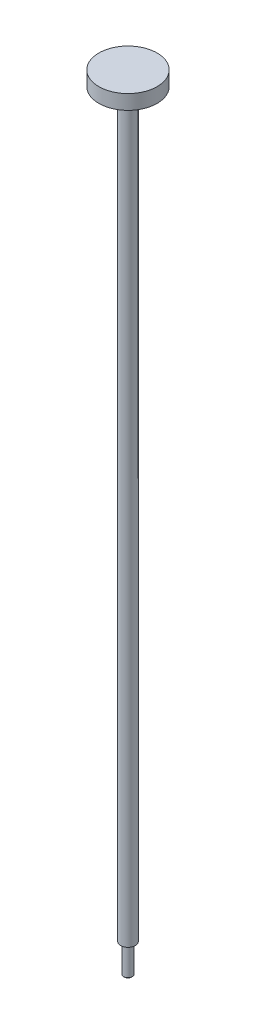
ISO-10303-21;
HEADER;
FILE_DESCRIPTION(('STEP AP214'),'2;1');
FILE_NAME('part.step','',(''),(''),'','','');
FILE_SCHEMA(('AUTOMOTIVE_DESIGN { 1 0 10303 214 1 1 1 1 }'));
ENDSEC;
DATA;
#1=APPLICATION_CONTEXT('core data for automotive mechanical design processes');
#2=APPLICATION_PROTOCOL_DEFINITION('international standard','automotive_design',2000,#1);
#3=PRODUCT_CONTEXT('',#1,'mechanical');
#4=PRODUCT('Part','Part','',(#3));
#5=PRODUCT_RELATED_PRODUCT_CATEGORY('part','',(#4));
#6=PRODUCT_DEFINITION_FORMATION('','',#4);
#7=PRODUCT_DEFINITION_CONTEXT('part definition',#1,'design');
#8=PRODUCT_DEFINITION('design','',#6,#7);
#9=PRODUCT_DEFINITION_SHAPE('','',#8);
#10=(LENGTH_UNIT() NAMED_UNIT(*) SI_UNIT(.MILLI.,.METRE.));
#11=(NAMED_UNIT(*) PLANE_ANGLE_UNIT() SI_UNIT($,.RADIAN.));
#12=(NAMED_UNIT(*) SI_UNIT($,.STERADIAN.) SOLID_ANGLE_UNIT());
#13=UNCERTAINTY_MEASURE_WITH_UNIT(LENGTH_MEASURE(1.E-05),#10,'distance_accuracy_value','');
#14=(GEOMETRIC_REPRESENTATION_CONTEXT(3) GLOBAL_UNCERTAINTY_ASSIGNED_CONTEXT((#13)) GLOBAL_UNIT_ASSIGNED_CONTEXT((#10,
#11,#12)) REPRESENTATION_CONTEXT('',''));
#15=CARTESIAN_POINT('',(0.,0.,0.));
#16=DIRECTION('',(0.,0.,1.));
#17=DIRECTION('',(1.,0.,0.));
#18=AXIS2_PLACEMENT_3D('',#15,#16,#17);
#19=CARTESIAN_POINT('',(0.,254.,0.));
#20=DIRECTION('',(0.,-1.,0.));
#21=DIRECTION('',(0.,0.,-1.));
#22=AXIS2_PLACEMENT_3D('',#19,#20,#21);
#23=CYLINDRICAL_SURFACE('',#22,2.5);
#24=CARTESIAN_POINT('',(0.,254.,0.));
#25=DIRECTION('',(0.,1.,0.));
#26=DIRECTION('',(0.,0.,1.));
#27=AXIS2_PLACEMENT_3D('',#24,#25,#26);
#28=CIRCLE('',#27,2.5);
#29=CARTESIAN_POINT('',(0.,254.,2.5));
#30=VERTEX_POINT('',#29);
#31=EDGE_CURVE('E10',#30,#30,#28,.T.);
#32=ORIENTED_EDGE('',*,*,#31,.F.);
#33=EDGE_LOOP('',(#32));
#34=FACE_BOUND('',#33,.T.);
#35=CARTESIAN_POINT('',(0.,0.,0.));
#36=DIRECTION('',(0.,1.,0.));
#37=DIRECTION('',(0.,0.,1.));
#38=AXIS2_PLACEMENT_3D('',#35,#36,#37);
#39=CIRCLE('',#38,2.5);
#40=CARTESIAN_POINT('',(0.,0.,2.5));
#41=VERTEX_POINT('',#40);
#42=EDGE_CURVE('E40',#41,#41,#39,.T.);
#43=ORIENTED_EDGE('',*,*,#42,.T.);
#44=EDGE_LOOP('',(#43));
#45=FACE_BOUND('',#44,.T.);
#46=ADVANCED_FACE('F37',(#34,#45),#23,.T.);
#47=CARTESIAN_POINT('',(0.,0.,0.));
#48=DIRECTION('',(0.,1.,0.));
#49=DIRECTION('',(0.,0.,1.));
#50=AXIS2_PLACEMENT_3D('',#47,#48,#49);
#51=PLANE('',#50);
#52=ORIENTED_EDGE('',*,*,#42,.F.);
#53=EDGE_LOOP('',(#52));
#54=FACE_BOUND('',#53,.T.);
#55=CARTESIAN_POINT('',(0.,0.,0.));
#56=DIRECTION('',(0.,1.,0.));
#57=DIRECTION('',(0.,0.,1.));
#58=AXIS2_PLACEMENT_3D('',#55,#56,#57);
#59=CIRCLE('',#58,1.5);
#60=CARTESIAN_POINT('',(0.,0.,1.5));
#61=VERTEX_POINT('',#60);
#62=EDGE_CURVE('E47',#61,#61,#59,.T.);
#63=ORIENTED_EDGE('',*,*,#62,.T.);
#64=EDGE_LOOP('',(#63));
#65=FACE_BOUND('',#64,.T.);
#66=ADVANCED_FACE('F81',(#54,#65),#51,.F.);
#67=CARTESIAN_POINT('',(0.,-10.,0.));
#68=DIRECTION('',(0.,1.,0.));
#69=DIRECTION('',(0.,0.,1.));
#70=AXIS2_PLACEMENT_3D('',#67,#68,#69);
#71=CYLINDRICAL_SURFACE('',#70,1.5);
#72=ORIENTED_EDGE('',*,*,#62,.F.);
#73=EDGE_LOOP('',(#72));
#74=FACE_BOUND('',#73,.T.);
#75=CARTESIAN_POINT('',(0.,-9.7195,0.));
#76=DIRECTION('',(0.,1.,0.));
#77=DIRECTION('',(0.,0.,1.));
#78=AXIS2_PLACEMENT_3D('',#75,#76,#77);
#79=CIRCLE('',#78,1.5);
#80=CARTESIAN_POINT('',(0.,-9.7195,1.5));
#81=VERTEX_POINT('',#80);
#82=EDGE_CURVE('E54',#81,#81,#79,.T.);
#83=ORIENTED_EDGE('',*,*,#82,.T.);
#84=EDGE_LOOP('',(#83));
#85=FACE_BOUND('',#84,.T.);
#86=ADVANCED_FACE('F86',(#74,#85),#71,.T.);
#87=CARTESIAN_POINT('',(0.,-10.,0.));
#88=DIRECTION('',(0.,1.,0.));
#89=DIRECTION('',(0.,0.,1.));
#90=AXIS2_PLACEMENT_3D('',#87,#88,#89);
#91=CONICAL_SURFACE('',#90,1.2195,0.78539816339745);
#92=ORIENTED_EDGE('',*,*,#82,.F.);
#93=EDGE_LOOP('',(#92));
#94=FACE_BOUND('',#93,.T.);
#95=CARTESIAN_POINT('',(0.,-10.,0.));
#96=DIRECTION('',(0.,1.,0.));
#97=DIRECTION('',(0.,0.,1.));
#98=AXIS2_PLACEMENT_3D('',#95,#96,#97);
#99=CIRCLE('',#98,1.2195);
#100=CARTESIAN_POINT('',(0.,-10.,1.2195));
#101=VERTEX_POINT('',#100);
#102=EDGE_CURVE('E51',#101,#101,#99,.T.);
#103=ORIENTED_EDGE('',*,*,#102,.T.);
#104=EDGE_LOOP('',(#103));
#105=FACE_BOUND('',#104,.T.);
#106=ADVANCED_FACE('F95',(#94,#105),#91,.T.);
#107=CARTESIAN_POINT('',(0.,-10.,0.));
#108=DIRECTION('',(0.,-1.,0.));
#109=DIRECTION('',(0.,0.,-1.));
#110=AXIS2_PLACEMENT_3D('',#107,#108,#109);
#111=PLANE('',#110);
#112=ORIENTED_EDGE('',*,*,#102,.F.);
#113=EDGE_LOOP('',(#112));
#114=FACE_BOUND('',#113,.T.);
#115=ADVANCED_FACE('F69',(#114),#111,.T.);
#116=CARTESIAN_POINT('',(0.,259.,0.));
#117=DIRECTION('',(0.,-1.,0.));
#118=DIRECTION('',(0.,0.,-1.));
#119=AXIS2_PLACEMENT_3D('',#116,#117,#118);
#120=CYLINDRICAL_SURFACE('',#119,10.);
#121=CARTESIAN_POINT('',(0.,259.,0.));
#122=DIRECTION('',(0.,1.,0.));
#123=DIRECTION('',(0.,0.,1.));
#124=AXIS2_PLACEMENT_3D('',#121,#122,#123);
#125=CIRCLE('',#124,10.);
#126=CARTESIAN_POINT('',(0.,259.,10.));
#127=VERTEX_POINT('',#126);
#128=EDGE_CURVE('E57',#127,#127,#125,.T.);
#129=ORIENTED_EDGE('',*,*,#128,.F.);
#130=EDGE_LOOP('',(#129));
#131=FACE_BOUND('',#130,.T.);
#132=CARTESIAN_POINT('',(0.,254.,0.));
#133=DIRECTION('',(0.,1.,0.));
#134=DIRECTION('',(0.,0.,1.));
#135=AXIS2_PLACEMENT_3D('',#132,#133,#134);
#136=CIRCLE('',#135,10.);
#137=CARTESIAN_POINT('',(0.,254.,10.));
#138=VERTEX_POINT('',#137);
#139=EDGE_CURVE('E58',#138,#138,#136,.T.);
#140=ORIENTED_EDGE('',*,*,#139,.T.);
#141=EDGE_LOOP('',(#140));
#142=FACE_BOUND('',#141,.T.);
#143=ADVANCED_FACE('F66',(#131,#142),#120,.T.);
#144=CARTESIAN_POINT('',(0.,259.,0.));
#145=DIRECTION('',(0.,1.,0.));
#146=DIRECTION('',(0.,0.,1.));
#147=AXIS2_PLACEMENT_3D('',#144,#145,#146);
#148=PLANE('',#147);
#149=ORIENTED_EDGE('',*,*,#128,.T.);
#150=EDGE_LOOP('',(#149));
#151=FACE_BOUND('',#150,.T.);
#152=ADVANCED_FACE('F64',(#151),#148,.T.);
#153=CARTESIAN_POINT('',(0.,254.,0.));
#154=DIRECTION('',(0.,1.,0.));
#155=DIRECTION('',(0.,0.,1.));
#156=AXIS2_PLACEMENT_3D('',#153,#154,#155);
#157=PLANE('',#156);
#158=ORIENTED_EDGE('',*,*,#31,.T.);
#159=EDGE_LOOP('',(#158));
#160=FACE_BOUND('',#159,.T.);
#161=ORIENTED_EDGE('',*,*,#139,.F.);
#162=EDGE_LOOP('',(#161));
#163=FACE_BOUND('',#162,.T.);
#164=ADVANCED_FACE('F73',(#160,#163),#157,.F.);
#165=CLOSED_SHELL('',(#46,#66,#86,#106,#115,#143,#152,#164));
#166=MANIFOLD_SOLID_BREP('B2',#165);
#167=ADVANCED_BREP_SHAPE_REPRESENTATION('',(#18,#166),#14);
#168=SHAPE_DEFINITION_REPRESENTATION(#9,#167);
ENDSEC;
END-ISO-10303-21;
